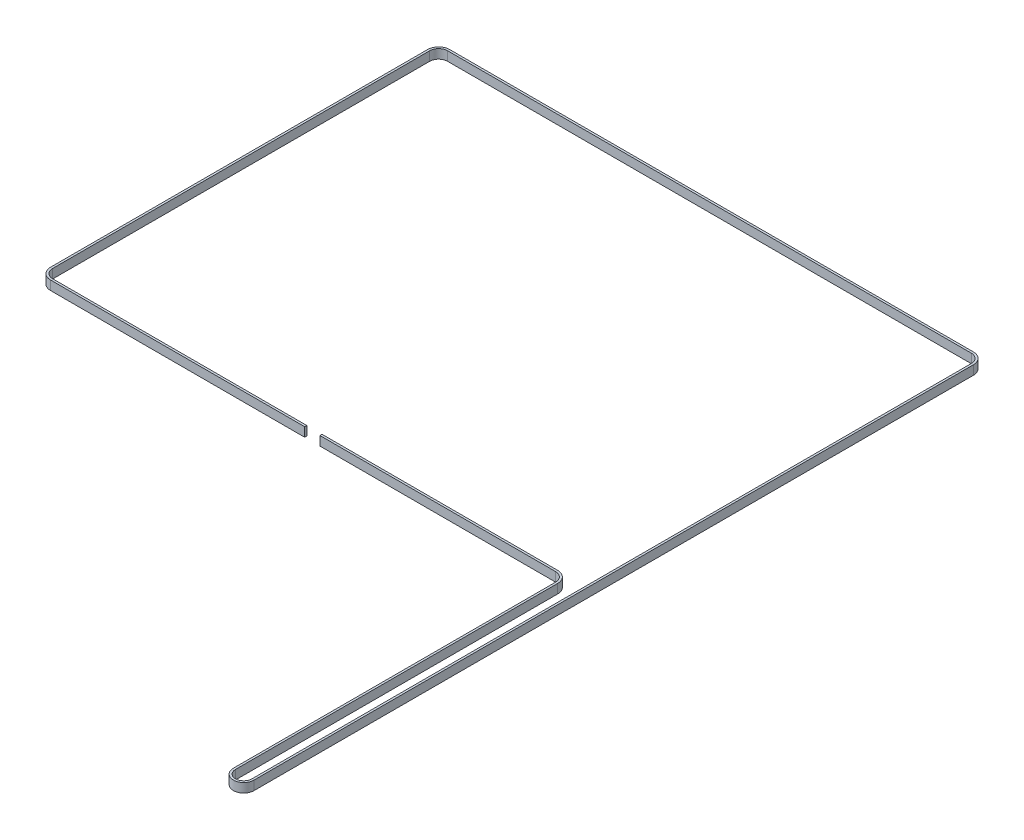
ISO-10303-21;
HEADER;
FILE_DESCRIPTION(('STEP AP214'),'2;1');
FILE_NAME('part.step','',(''),(''),'','','');
FILE_SCHEMA(('AUTOMOTIVE_DESIGN { 1 0 10303 214 1 1 1 1 }'));
ENDSEC;
DATA;
#1=APPLICATION_CONTEXT('core data for automotive mechanical design processes');
#2=APPLICATION_PROTOCOL_DEFINITION('international standard','automotive_design',2000,#1);
#3=PRODUCT_CONTEXT('',#1,'mechanical');
#4=PRODUCT('Part','Part','',(#3));
#5=PRODUCT_RELATED_PRODUCT_CATEGORY('part','',(#4));
#6=PRODUCT_DEFINITION_FORMATION('','',#4);
#7=PRODUCT_DEFINITION_CONTEXT('part definition',#1,'design');
#8=PRODUCT_DEFINITION('design','',#6,#7);
#9=PRODUCT_DEFINITION_SHAPE('','',#8);
#10=(LENGTH_UNIT() NAMED_UNIT(*) SI_UNIT(.MILLI.,.METRE.));
#11=(NAMED_UNIT(*) PLANE_ANGLE_UNIT() SI_UNIT($,.RADIAN.));
#12=(NAMED_UNIT(*) SI_UNIT($,.STERADIAN.) SOLID_ANGLE_UNIT());
#13=UNCERTAINTY_MEASURE_WITH_UNIT(LENGTH_MEASURE(1.E-05),#10,'distance_accuracy_value','');
#14=(GEOMETRIC_REPRESENTATION_CONTEXT(3) GLOBAL_UNCERTAINTY_ASSIGNED_CONTEXT((#13)) GLOBAL_UNIT_ASSIGNED_CONTEXT((#10,
#11,#12)) REPRESENTATION_CONTEXT('',''));
#15=CARTESIAN_POINT('',(0.,0.,0.));
#16=DIRECTION('',(0.,0.,1.));
#17=DIRECTION('',(1.,0.,0.));
#18=AXIS2_PLACEMENT_3D('',#15,#16,#17);
#19=CARTESIAN_POINT('',(6.87500000000002,6.,261.023481844307));
#20=DIRECTION('',(0.,0.,-1.));
#21=DIRECTION('',(-1.,0.,0.));
#22=AXIS2_PLACEMENT_3D('',#19,#20,#21);
#23=PLANE('',#22);
#24=DIRECTION('',(1.,0.,0.));
#25=VECTOR('',#24,1.);
#26=CARTESIAN_POINT('',(6.87500000000002,0.,261.023481844307));
#27=LINE('',#26,#25);
#28=CARTESIAN_POINT('',(6.87500000000002,0.,261.023481844307));
#29=VERTEX_POINT('',#28);
#30=CARTESIAN_POINT('',(173.28,0.,261.023481844307));
#31=VERTEX_POINT('',#30);
#32=EDGE_CURVE('E241',#29,#31,#27,.T.);
#33=ORIENTED_EDGE('',*,*,#32,.T.);
#34=DIRECTION('',(0.,-1.,0.));
#35=VECTOR('',#34,1.);
#36=CARTESIAN_POINT('',(173.28,6.,261.023481844307));
#37=LINE('',#36,#35);
#38=CARTESIAN_POINT('',(173.28,6.,261.023481844307));
#39=VERTEX_POINT('',#38);
#40=EDGE_CURVE('E11',#39,#31,#37,.T.);
#41=ORIENTED_EDGE('',*,*,#40,.F.);
#42=DIRECTION('',(1.,0.,0.));
#43=VECTOR('',#42,1.);
#44=CARTESIAN_POINT('',(6.87500000000002,6.,261.023481844307));
#45=LINE('',#44,#43);
#46=CARTESIAN_POINT('',(6.87500000000002,6.,261.023481844307));
#47=VERTEX_POINT('',#46);
#48=EDGE_CURVE('E150',#47,#39,#45,.T.);
#49=ORIENTED_EDGE('',*,*,#48,.F.);
#50=DIRECTION('',(0.,-1.,0.));
#51=VECTOR('',#50,1.);
#52=CARTESIAN_POINT('',(6.87500000000002,6.,261.023481844307));
#53=LINE('',#52,#51);
#54=EDGE_CURVE('E237',#47,#29,#53,.T.);
#55=ORIENTED_EDGE('',*,*,#54,.T.);
#56=EDGE_LOOP('',(#33,#41,#49,#55));
#57=FACE_BOUND('',#56,.T.);
#58=ADVANCED_FACE('F45',(#57),#23,.F.);
#59=CARTESIAN_POINT('',(173.28,6.,259.643481844307));
#60=DIRECTION('',(1.,0.,0.));
#61=DIRECTION('',(0.,0.,-1.));
#62=AXIS2_PLACEMENT_3D('',#59,#60,#61);
#63=PLANE('',#62);
#64=DIRECTION('',(0.,0.,1.));
#65=VECTOR('',#64,1.);
#66=CARTESIAN_POINT('',(173.28,0.,259.643481844307));
#67=LINE('',#66,#65);
#68=CARTESIAN_POINT('',(173.28,0.,259.643481844307));
#69=VERTEX_POINT('',#68);
#70=EDGE_CURVE('E245',#69,#31,#67,.T.);
#71=ORIENTED_EDGE('',*,*,#70,.F.);
#72=DIRECTION('',(0.,-1.,0.));
#73=VECTOR('',#72,1.);
#74=CARTESIAN_POINT('',(173.28,6.,259.643481844307));
#75=LINE('',#74,#73);
#76=CARTESIAN_POINT('',(173.28,6.,259.643481844307));
#77=VERTEX_POINT('',#76);
#78=EDGE_CURVE('E54',#77,#69,#75,.T.);
#79=ORIENTED_EDGE('',*,*,#78,.F.);
#80=DIRECTION('',(0.,0.,1.));
#81=VECTOR('',#80,1.);
#82=CARTESIAN_POINT('',(173.28,6.,259.643481844307));
#83=LINE('',#82,#81);
#84=EDGE_CURVE('E412',#77,#39,#83,.T.);
#85=ORIENTED_EDGE('',*,*,#84,.T.);
#86=ORIENTED_EDGE('',*,*,#40,.T.);
#87=EDGE_LOOP('',(#71,#79,#85,#86));
#88=FACE_BOUND('',#87,.T.);
#89=ADVANCED_FACE('F399',(#88),#63,.T.);
#90=CARTESIAN_POINT('',(6.87500000000002,6.,259.643481844307));
#91=DIRECTION('',(0.,0.,-1.));
#92=DIRECTION('',(-1.,0.,0.));
#93=AXIS2_PLACEMENT_3D('',#90,#91,#92);
#94=PLANE('',#93);
#95=DIRECTION('',(1.,0.,0.));
#96=VECTOR('',#95,1.);
#97=CARTESIAN_POINT('',(6.87500000000002,0.,259.643481844307));
#98=LINE('',#97,#96);
#99=CARTESIAN_POINT('',(6.87500000000002,0.,259.643481844307));
#100=VERTEX_POINT('',#99);
#101=EDGE_CURVE('E249',#100,#69,#98,.T.);
#102=ORIENTED_EDGE('',*,*,#101,.F.);
#103=DIRECTION('',(0.,-1.,0.));
#104=VECTOR('',#103,1.);
#105=CARTESIAN_POINT('',(6.87500000000002,6.,259.643481844307));
#106=LINE('',#105,#104);
#107=CARTESIAN_POINT('',(6.87500000000002,6.,259.643481844307));
#108=VERTEX_POINT('',#107);
#109=EDGE_CURVE('E387',#108,#100,#106,.T.);
#110=ORIENTED_EDGE('',*,*,#109,.F.);
#111=DIRECTION('',(1.,0.,0.));
#112=VECTOR('',#111,1.);
#113=CARTESIAN_POINT('',(6.87500000000002,6.,259.643481844307));
#114=LINE('',#113,#112);
#115=EDGE_CURVE('E396',#108,#77,#114,.T.);
#116=ORIENTED_EDGE('',*,*,#115,.T.);
#117=ORIENTED_EDGE('',*,*,#78,.T.);
#118=EDGE_LOOP('',(#102,#110,#116,#117));
#119=FACE_BOUND('',#118,.T.);
#120=ADVANCED_FACE('F394',(#119),#94,.T.);
#121=CARTESIAN_POINT('',(6.87500000000002,6.,253.772481844307));
#122=DIRECTION('',(0.,-1.,0.));
#123=DIRECTION('',(0.,0.,-1.));
#124=AXIS2_PLACEMENT_3D('',#121,#122,#123);
#125=CYLINDRICAL_SURFACE('',#124,5.87100000000002);
#126=CARTESIAN_POINT('',(6.87500000000002,0.,253.772481844307));
#127=DIRECTION('',(0.,1.,0.));
#128=DIRECTION('',(1.,0.,0.));
#129=AXIS2_PLACEMENT_3D('',#126,#127,#128);
#130=CIRCLE('',#129,5.87100000000002);
#131=CARTESIAN_POINT('',(1.004,0.,253.772481844307));
#132=VERTEX_POINT('',#131);
#133=EDGE_CURVE('E253',#132,#100,#130,.T.);
#134=ORIENTED_EDGE('',*,*,#133,.F.);
#135=DIRECTION('',(0.,-1.,0.));
#136=VECTOR('',#135,1.);
#137=CARTESIAN_POINT('',(1.004,6.,253.772481844307));
#138=LINE('',#137,#136);
#139=CARTESIAN_POINT('',(1.004,6.,253.772481844307));
#140=VERTEX_POINT('',#139);
#141=EDGE_CURVE('E384',#140,#132,#138,.T.);
#142=ORIENTED_EDGE('',*,*,#141,.F.);
#143=CARTESIAN_POINT('',(6.87500000000002,6.,253.772481844307));
#144=DIRECTION('',(0.,1.,0.));
#145=DIRECTION('',(1.,0.,0.));
#146=AXIS2_PLACEMENT_3D('',#143,#144,#145);
#147=CIRCLE('',#146,5.87100000000002);
#148=EDGE_CURVE('E409',#140,#108,#147,.T.);
#149=ORIENTED_EDGE('',*,*,#148,.T.);
#150=ORIENTED_EDGE('',*,*,#109,.T.);
#151=EDGE_LOOP('',(#134,#142,#149,#150));
#152=FACE_BOUND('',#151,.T.);
#153=ADVANCED_FACE('F406',(#152),#125,.F.);
#154=CARTESIAN_POINT('',(1.004,6.,6.875));
#155=DIRECTION('',(1.,0.,0.));
#156=DIRECTION('',(0.,0.,-1.));
#157=AXIS2_PLACEMENT_3D('',#154,#155,#156);
#158=PLANE('',#157);
#159=DIRECTION('',(0.,0.,-1.));
#160=VECTOR('',#159,1.);
#161=CARTESIAN_POINT('',(1.004,0.,6.875));
#162=LINE('',#161,#160);
#163=CARTESIAN_POINT('',(1.004,0.,6.875));
#164=VERTEX_POINT('',#163);
#165=EDGE_CURVE('E257',#164,#132,#162,.F.);
#166=ORIENTED_EDGE('',*,*,#165,.F.);
#167=DIRECTION('',(0.,-1.,0.));
#168=VECTOR('',#167,1.);
#169=CARTESIAN_POINT('',(1.004,6.,6.875));
#170=LINE('',#169,#168);
#171=CARTESIAN_POINT('',(1.004,6.,6.875));
#172=VERTEX_POINT('',#171);
#173=EDGE_CURVE('E381',#172,#164,#170,.T.);
#174=ORIENTED_EDGE('',*,*,#173,.F.);
#175=DIRECTION('',(0.,0.,-1.));
#176=VECTOR('',#175,1.);
#177=CARTESIAN_POINT('',(1.004,6.,6.875));
#178=LINE('',#177,#176);
#179=EDGE_CURVE('E417',#172,#140,#178,.F.);
#180=ORIENTED_EDGE('',*,*,#179,.T.);
#181=ORIENTED_EDGE('',*,*,#141,.T.);
#182=EDGE_LOOP('',(#166,#174,#180,#181));
#183=FACE_BOUND('',#182,.T.);
#184=ADVANCED_FACE('F510',(#183),#158,.T.);
#185=CARTESIAN_POINT('',(6.875,6.,6.875));
#186=DIRECTION('',(0.,-1.,0.));
#187=DIRECTION('',(0.,0.,-1.));
#188=AXIS2_PLACEMENT_3D('',#185,#186,#187);
#189=CYLINDRICAL_SURFACE('',#188,5.871);
#190=CARTESIAN_POINT('',(6.875,0.,6.875));
#191=DIRECTION('',(0.,1.,0.));
#192=DIRECTION('',(1.,0.,0.));
#193=AXIS2_PLACEMENT_3D('',#190,#191,#192);
#194=CIRCLE('',#193,5.871);
#195=CARTESIAN_POINT('',(6.875,0.,1.004));
#196=VERTEX_POINT('',#195);
#197=EDGE_CURVE('E261',#196,#164,#194,.T.);
#198=ORIENTED_EDGE('',*,*,#197,.F.);
#199=DIRECTION('',(0.,-1.,0.));
#200=VECTOR('',#199,1.);
#201=CARTESIAN_POINT('',(6.875,6.,1.004));
#202=LINE('',#201,#200);
#203=CARTESIAN_POINT('',(6.875,6.,1.004));
#204=VERTEX_POINT('',#203);
#205=EDGE_CURVE('E378',#204,#196,#202,.T.);
#206=ORIENTED_EDGE('',*,*,#205,.F.);
#207=CARTESIAN_POINT('',(6.875,6.,6.875));
#208=DIRECTION('',(0.,1.,0.));
#209=DIRECTION('',(1.,0.,0.));
#210=AXIS2_PLACEMENT_3D('',#207,#208,#209);
#211=CIRCLE('',#210,5.871);
#212=EDGE_CURVE('E424',#204,#172,#211,.T.);
#213=ORIENTED_EDGE('',*,*,#212,.T.);
#214=ORIENTED_EDGE('',*,*,#173,.T.);
#215=EDGE_LOOP('',(#198,#206,#213,#214));
#216=FACE_BOUND('',#215,.T.);
#217=ADVANCED_FACE('F513',(#216),#189,.F.);
#218=CARTESIAN_POINT('',(6.875,6.,1.004));
#219=DIRECTION('',(0.,0.,1.));
#220=DIRECTION('',(1.,0.,0.));
#221=AXIS2_PLACEMENT_3D('',#218,#219,#220);
#222=PLANE('',#221);
#223=DIRECTION('',(1.,0.,0.));
#224=VECTOR('',#223,1.);
#225=CARTESIAN_POINT('',(6.875,0.,1.004));
#226=LINE('',#225,#224);
#227=CARTESIAN_POINT('',(349.875,0.,1.004));
#228=VERTEX_POINT('',#227);
#229=EDGE_CURVE('E265',#228,#196,#226,.F.);
#230=ORIENTED_EDGE('',*,*,#229,.F.);
#231=DIRECTION('',(0.,-1.,0.));
#232=VECTOR('',#231,1.);
#233=CARTESIAN_POINT('',(349.875,6.,1.004));
#234=LINE('',#233,#232);
#235=CARTESIAN_POINT('',(349.875,6.,1.004));
#236=VERTEX_POINT('',#235);
#237=EDGE_CURVE('E375',#236,#228,#234,.T.);
#238=ORIENTED_EDGE('',*,*,#237,.F.);
#239=DIRECTION('',(1.,0.,0.));
#240=VECTOR('',#239,1.);
#241=CARTESIAN_POINT('',(6.875,6.,1.004));
#242=LINE('',#241,#240);
#243=EDGE_CURVE('E428',#236,#204,#242,.F.);
#244=ORIENTED_EDGE('',*,*,#243,.T.);
#245=ORIENTED_EDGE('',*,*,#205,.T.);
#246=EDGE_LOOP('',(#230,#238,#244,#245));
#247=FACE_BOUND('',#246,.T.);
#248=ADVANCED_FACE('F517',(#247),#222,.T.);
#249=CARTESIAN_POINT('',(349.875,6.,6.875));
#250=DIRECTION('',(0.,-1.,0.));
#251=DIRECTION('',(0.,0.,-1.));
#252=AXIS2_PLACEMENT_3D('',#249,#250,#251);
#253=CYLINDRICAL_SURFACE('',#252,5.87100000000001);
#254=CARTESIAN_POINT('',(349.875,0.,6.875));
#255=DIRECTION('',(0.,1.,0.));
#256=DIRECTION('',(1.,0.,0.));
#257=AXIS2_PLACEMENT_3D('',#254,#255,#256);
#258=CIRCLE('',#257,5.87100000000001);
#259=CARTESIAN_POINT('',(355.746,0.,6.875));
#260=VERTEX_POINT('',#259);
#261=EDGE_CURVE('E269',#260,#228,#258,.T.);
#262=ORIENTED_EDGE('',*,*,#261,.F.);
#263=DIRECTION('',(0.,-1.,0.));
#264=VECTOR('',#263,1.);
#265=CARTESIAN_POINT('',(355.746,6.,6.875));
#266=LINE('',#265,#264);
#267=CARTESIAN_POINT('',(355.746,6.,6.875));
#268=VERTEX_POINT('',#267);
#269=EDGE_CURVE('E372',#268,#260,#266,.T.);
#270=ORIENTED_EDGE('',*,*,#269,.F.);
#271=CARTESIAN_POINT('',(349.875,6.,6.875));
#272=DIRECTION('',(0.,1.,0.));
#273=DIRECTION('',(1.,0.,0.));
#274=AXIS2_PLACEMENT_3D('',#271,#272,#273);
#275=CIRCLE('',#274,5.87100000000001);
#276=EDGE_CURVE('E432',#268,#236,#275,.T.);
#277=ORIENTED_EDGE('',*,*,#276,.T.);
#278=ORIENTED_EDGE('',*,*,#237,.T.);
#279=EDGE_LOOP('',(#262,#270,#277,#278));
#280=FACE_BOUND('',#279,.T.);
#281=ADVANCED_FACE('F521',(#280),#253,.F.);
#282=CARTESIAN_POINT('',(355.746,6.,6.875));
#283=DIRECTION('',(-1.,0.,0.));
#284=DIRECTION('',(0.,0.,1.));
#285=AXIS2_PLACEMENT_3D('',#282,#283,#284);
#286=PLANE('',#285);
#287=DIRECTION('',(0.,0.,-1.));
#288=VECTOR('',#287,1.);
#289=CARTESIAN_POINT('',(355.746,0.,6.875));
#290=LINE('',#289,#288);
#291=CARTESIAN_POINT('',(355.746,0.,478.035));
#292=VERTEX_POINT('',#291);
#293=EDGE_CURVE('E273',#292,#260,#290,.T.);
#294=ORIENTED_EDGE('',*,*,#293,.F.);
#295=DIRECTION('',(0.,-1.,0.));
#296=VECTOR('',#295,1.);
#297=CARTESIAN_POINT('',(355.746,6.,478.035));
#298=LINE('',#297,#296);
#299=CARTESIAN_POINT('',(355.746,6.,478.035));
#300=VERTEX_POINT('',#299);
#301=EDGE_CURVE('E369',#300,#292,#298,.T.);
#302=ORIENTED_EDGE('',*,*,#301,.F.);
#303=DIRECTION('',(0.,0.,-1.));
#304=VECTOR('',#303,1.);
#305=CARTESIAN_POINT('',(355.746,6.,6.875));
#306=LINE('',#305,#304);
#307=EDGE_CURVE('E436',#300,#268,#306,.T.);
#308=ORIENTED_EDGE('',*,*,#307,.T.);
#309=ORIENTED_EDGE('',*,*,#269,.T.);
#310=EDGE_LOOP('',(#294,#302,#308,#309));
#311=FACE_BOUND('',#310,.T.);
#312=ADVANCED_FACE('F525',(#311),#286,.T.);
#313=CARTESIAN_POINT('',(350.38,6.,478.035));
#314=DIRECTION('',(0.,-1.,0.));
#315=DIRECTION('',(0.,0.,-1.));
#316=AXIS2_PLACEMENT_3D('',#313,#314,#315);
#317=CYLINDRICAL_SURFACE('',#316,5.36599999999996);
#318=CARTESIAN_POINT('',(350.38,0.,478.035));
#319=DIRECTION('',(0.,1.,0.));
#320=DIRECTION('',(1.,0.,0.));
#321=AXIS2_PLACEMENT_3D('',#318,#319,#320);
#322=CIRCLE('',#321,5.36599999999996);
#323=CARTESIAN_POINT('',(345.014,0.,478.035));
#324=VERTEX_POINT('',#323);
#325=EDGE_CURVE('E277',#324,#292,#322,.T.);
#326=ORIENTED_EDGE('',*,*,#325,.F.);
#327=DIRECTION('',(0.,-1.,0.));
#328=VECTOR('',#327,1.);
#329=CARTESIAN_POINT('',(345.014,6.,478.035));
#330=LINE('',#329,#328);
#331=CARTESIAN_POINT('',(345.014,6.,478.035));
#332=VERTEX_POINT('',#331);
#333=EDGE_CURVE('E366',#332,#324,#330,.T.);
#334=ORIENTED_EDGE('',*,*,#333,.F.);
#335=CARTESIAN_POINT('',(350.38,6.,478.035));
#336=DIRECTION('',(0.,1.,0.));
#337=DIRECTION('',(1.,0.,0.));
#338=AXIS2_PLACEMENT_3D('',#335,#336,#337);
#339=CIRCLE('',#338,5.36599999999996);
#340=EDGE_CURVE('E440',#332,#300,#339,.T.);
#341=ORIENTED_EDGE('',*,*,#340,.T.);
#342=ORIENTED_EDGE('',*,*,#301,.T.);
#343=EDGE_LOOP('',(#326,#334,#341,#342));
#344=FACE_BOUND('',#343,.T.);
#345=ADVANCED_FACE('F529',(#344),#317,.F.);
#346=CARTESIAN_POINT('',(345.014,6.,478.035));
#347=DIRECTION('',(1.,0.,0.));
#348=DIRECTION('',(0.,0.,-1.));
#349=AXIS2_PLACEMENT_3D('',#346,#347,#348);
#350=PLANE('',#349);
#351=DIRECTION('',(0.,0.,1.));
#352=VECTOR('',#351,1.);
#353=CARTESIAN_POINT('',(345.014,0.,478.035));
#354=LINE('',#353,#352);
#355=CARTESIAN_POINT('',(345.014,0.,267.017481844307));
#356=VERTEX_POINT('',#355);
#357=EDGE_CURVE('E281',#356,#324,#354,.T.);
#358=ORIENTED_EDGE('',*,*,#357,.F.);
#359=DIRECTION('',(0.,-1.,0.));
#360=VECTOR('',#359,1.);
#361=CARTESIAN_POINT('',(345.014,6.,267.017481844307));
#362=LINE('',#361,#360);
#363=CARTESIAN_POINT('',(345.014,6.,267.017481844307));
#364=VERTEX_POINT('',#363);
#365=EDGE_CURVE('E363',#364,#356,#362,.T.);
#366=ORIENTED_EDGE('',*,*,#365,.F.);
#367=DIRECTION('',(0.,0.,1.));
#368=VECTOR('',#367,1.);
#369=CARTESIAN_POINT('',(345.014,6.,478.035));
#370=LINE('',#369,#368);
#371=EDGE_CURVE('E444',#364,#332,#370,.T.);
#372=ORIENTED_EDGE('',*,*,#371,.T.);
#373=ORIENTED_EDGE('',*,*,#333,.T.);
#374=EDGE_LOOP('',(#358,#366,#372,#373));
#375=FACE_BOUND('',#374,.T.);
#376=ADVANCED_FACE('F533',(#375),#350,.T.);
#377=CARTESIAN_POINT('',(337.64,6.,267.017481844307));
#378=DIRECTION('',(0.,-1.,0.));
#379=DIRECTION('',(0.,0.,-1.));
#380=AXIS2_PLACEMENT_3D('',#377,#378,#379);
#381=CYLINDRICAL_SURFACE('',#380,7.37399999999996);
#382=CARTESIAN_POINT('',(337.64,0.,267.017481844307));
#383=DIRECTION('',(0.,1.,0.));
#384=DIRECTION('',(1.,0.,0.));
#385=AXIS2_PLACEMENT_3D('',#382,#383,#384);
#386=CIRCLE('',#385,7.37399999999996);
#387=CARTESIAN_POINT('',(337.64,0.,259.643481844308));
#388=VERTEX_POINT('',#387);
#389=EDGE_CURVE('E285',#388,#356,#386,.F.);
#390=ORIENTED_EDGE('',*,*,#389,.F.);
#391=DIRECTION('',(0.,-1.,0.));
#392=VECTOR('',#391,1.);
#393=CARTESIAN_POINT('',(337.64,6.,259.643481844308));
#394=LINE('',#393,#392);
#395=CARTESIAN_POINT('',(337.64,6.,259.643481844308));
#396=VERTEX_POINT('',#395);
#397=EDGE_CURVE('E360',#396,#388,#394,.T.);
#398=ORIENTED_EDGE('',*,*,#397,.F.);
#399=CARTESIAN_POINT('',(337.64,6.,267.017481844307));
#400=DIRECTION('',(0.,1.,0.));
#401=DIRECTION('',(1.,0.,0.));
#402=AXIS2_PLACEMENT_3D('',#399,#400,#401);
#403=CIRCLE('',#402,7.37399999999996);
#404=EDGE_CURVE('E448',#396,#364,#403,.F.);
#405=ORIENTED_EDGE('',*,*,#404,.T.);
#406=ORIENTED_EDGE('',*,*,#365,.T.);
#407=EDGE_LOOP('',(#390,#398,#405,#406));
#408=FACE_BOUND('',#407,.T.);
#409=ADVANCED_FACE('F537',(#408),#381,.T.);
#410=CARTESIAN_POINT('',(337.64,6.,259.643481844307));
#411=DIRECTION('',(0.,0.,-1.));
#412=DIRECTION('',(-1.,0.,0.));
#413=AXIS2_PLACEMENT_3D('',#410,#411,#412);
#414=PLANE('',#413);
#415=DIRECTION('',(1.,0.,0.));
#416=VECTOR('',#415,1.);
#417=CARTESIAN_POINT('',(337.64,0.,259.643481844307));
#418=LINE('',#417,#416);
#419=CARTESIAN_POINT('',(183.275,0.,259.643481844307));
#420=VERTEX_POINT('',#419);
#421=EDGE_CURVE('E289',#420,#388,#418,.T.);
#422=ORIENTED_EDGE('',*,*,#421,.F.);
#423=DIRECTION('',(0.,-1.,0.));
#424=VECTOR('',#423,1.);
#425=CARTESIAN_POINT('',(183.275,6.,259.643481844307));
#426=LINE('',#425,#424);
#427=CARTESIAN_POINT('',(183.275,6.,259.643481844307));
#428=VERTEX_POINT('',#427);
#429=EDGE_CURVE('E357',#428,#420,#426,.T.);
#430=ORIENTED_EDGE('',*,*,#429,.F.);
#431=DIRECTION('',(1.,0.,0.));
#432=VECTOR('',#431,1.);
#433=CARTESIAN_POINT('',(337.64,6.,259.643481844307));
#434=LINE('',#433,#432);
#435=EDGE_CURVE('E452',#428,#396,#434,.T.);
#436=ORIENTED_EDGE('',*,*,#435,.T.);
#437=ORIENTED_EDGE('',*,*,#397,.T.);
#438=EDGE_LOOP('',(#422,#430,#436,#437));
#439=FACE_BOUND('',#438,.T.);
#440=ADVANCED_FACE('F541',(#439),#414,.T.);
#441=CARTESIAN_POINT('',(183.275,6.,261.023481844307));
#442=DIRECTION('',(-1.,0.,0.));
#443=DIRECTION('',(0.,0.,1.));
#444=AXIS2_PLACEMENT_3D('',#441,#442,#443);
#445=PLANE('',#444);
#446=DIRECTION('',(0.,0.,-1.));
#447=VECTOR('',#446,1.);
#448=CARTESIAN_POINT('',(183.275,0.,261.023481844307));
#449=LINE('',#448,#447);
#450=CARTESIAN_POINT('',(183.275,0.,261.023481844307));
#451=VERTEX_POINT('',#450);
#452=EDGE_CURVE('E293',#451,#420,#449,.T.);
#453=ORIENTED_EDGE('',*,*,#452,.F.);
#454=DIRECTION('',(0.,-1.,0.));
#455=VECTOR('',#454,1.);
#456=CARTESIAN_POINT('',(183.275,6.,261.023481844307));
#457=LINE('',#456,#455);
#458=CARTESIAN_POINT('',(183.275,6.,261.023481844307));
#459=VERTEX_POINT('',#458);
#460=EDGE_CURVE('E354',#459,#451,#457,.T.);
#461=ORIENTED_EDGE('',*,*,#460,.F.);
#462=DIRECTION('',(0.,0.,-1.));
#463=VECTOR('',#462,1.);
#464=CARTESIAN_POINT('',(183.275,6.,261.023481844307));
#465=LINE('',#464,#463);
#466=EDGE_CURVE('E456',#459,#428,#465,.T.);
#467=ORIENTED_EDGE('',*,*,#466,.T.);
#468=ORIENTED_EDGE('',*,*,#429,.T.);
#469=EDGE_LOOP('',(#453,#461,#467,#468));
#470=FACE_BOUND('',#469,.T.);
#471=ADVANCED_FACE('F545',(#470),#445,.T.);
#472=CARTESIAN_POINT('',(337.64,6.,261.023481844307));
#473=DIRECTION('',(0.,0.,-1.));
#474=DIRECTION('',(-1.,0.,0.));
#475=AXIS2_PLACEMENT_3D('',#472,#473,#474);
#476=PLANE('',#475);
#477=DIRECTION('',(1.,0.,0.));
#478=VECTOR('',#477,1.);
#479=CARTESIAN_POINT('',(337.64,0.,261.023481844307));
#480=LINE('',#479,#478);
#481=CARTESIAN_POINT('',(337.64,0.,261.023481844308));
#482=VERTEX_POINT('',#481);
#483=EDGE_CURVE('E297',#451,#482,#480,.T.);
#484=ORIENTED_EDGE('',*,*,#483,.T.);
#485=DIRECTION('',(0.,-1.,0.));
#486=VECTOR('',#485,1.);
#487=CARTESIAN_POINT('',(337.64,6.,261.023481844308));
#488=LINE('',#487,#486);
#489=CARTESIAN_POINT('',(337.64,6.,261.023481844308));
#490=VERTEX_POINT('',#489);
#491=EDGE_CURVE('E350',#490,#482,#488,.T.);
#492=ORIENTED_EDGE('',*,*,#491,.F.);
#493=DIRECTION('',(1.,0.,0.));
#494=VECTOR('',#493,1.);
#495=CARTESIAN_POINT('',(337.64,6.,261.023481844307));
#496=LINE('',#495,#494);
#497=EDGE_CURVE('E460',#459,#490,#496,.T.);
#498=ORIENTED_EDGE('',*,*,#497,.F.);
#499=ORIENTED_EDGE('',*,*,#460,.T.);
#500=EDGE_LOOP('',(#484,#492,#498,#499));
#501=FACE_BOUND('',#500,.T.);
#502=ADVANCED_FACE('F549',(#501),#476,.F.);
#503=CARTESIAN_POINT('',(337.64,6.,267.017481844307));
#504=DIRECTION('',(0.,-1.,0.));
#505=DIRECTION('',(0.,0.,-1.));
#506=AXIS2_PLACEMENT_3D('',#503,#504,#505);
#507=CYLINDRICAL_SURFACE('',#506,5.99399999999996);
#508=CARTESIAN_POINT('',(337.64,0.,267.017481844307));
#509=DIRECTION('',(0.,1.,0.));
#510=DIRECTION('',(1.,0.,0.));
#511=AXIS2_PLACEMENT_3D('',#508,#509,#510);
#512=CIRCLE('',#511,5.99399999999996);
#513=CARTESIAN_POINT('',(343.634,0.,267.017481844307));
#514=VERTEX_POINT('',#513);
#515=EDGE_CURVE('E300',#482,#514,#512,.F.);
#516=ORIENTED_EDGE('',*,*,#515,.T.);
#517=DIRECTION('',(0.,-1.,0.));
#518=VECTOR('',#517,1.);
#519=CARTESIAN_POINT('',(343.634,6.,267.017481844307));
#520=LINE('',#519,#518);
#521=CARTESIAN_POINT('',(343.634,6.,267.017481844307));
#522=VERTEX_POINT('',#521);
#523=EDGE_CURVE('E346',#522,#514,#520,.T.);
#524=ORIENTED_EDGE('',*,*,#523,.F.);
#525=CARTESIAN_POINT('',(337.64,6.,267.017481844307));
#526=DIRECTION('',(0.,1.,0.));
#527=DIRECTION('',(1.,0.,0.));
#528=AXIS2_PLACEMENT_3D('',#525,#526,#527);
#529=CIRCLE('',#528,5.99399999999996);
#530=EDGE_CURVE('E463',#490,#522,#529,.F.);
#531=ORIENTED_EDGE('',*,*,#530,.F.);
#532=ORIENTED_EDGE('',*,*,#491,.T.);
#533=EDGE_LOOP('',(#516,#524,#531,#532));
#534=FACE_BOUND('',#533,.T.);
#535=ADVANCED_FACE('F553',(#534),#507,.F.);
#536=CARTESIAN_POINT('',(343.634,6.,478.035));
#537=DIRECTION('',(1.,0.,0.));
#538=DIRECTION('',(0.,0.,-1.));
#539=AXIS2_PLACEMENT_3D('',#536,#537,#538);
#540=PLANE('',#539);
#541=DIRECTION('',(0.,0.,1.));
#542=VECTOR('',#541,1.);
#543=CARTESIAN_POINT('',(343.634,0.,478.035));
#544=LINE('',#543,#542);
#545=CARTESIAN_POINT('',(343.634,0.,478.035));
#546=VERTEX_POINT('',#545);
#547=EDGE_CURVE('E303',#514,#546,#544,.T.);
#548=ORIENTED_EDGE('',*,*,#547,.T.);
#549=DIRECTION('',(0.,-1.,0.));
#550=VECTOR('',#549,1.);
#551=CARTESIAN_POINT('',(343.634,6.,478.035));
#552=LINE('',#551,#550);
#553=CARTESIAN_POINT('',(343.634,6.,478.035));
#554=VERTEX_POINT('',#553);
#555=EDGE_CURVE('E342',#554,#546,#552,.T.);
#556=ORIENTED_EDGE('',*,*,#555,.F.);
#557=DIRECTION('',(0.,0.,1.));
#558=VECTOR('',#557,1.);
#559=CARTESIAN_POINT('',(343.634,6.,478.035));
#560=LINE('',#559,#558);
#561=EDGE_CURVE('E466',#522,#554,#560,.T.);
#562=ORIENTED_EDGE('',*,*,#561,.F.);
#563=ORIENTED_EDGE('',*,*,#523,.T.);
#564=EDGE_LOOP('',(#548,#556,#562,#563));
#565=FACE_BOUND('',#564,.T.);
#566=ADVANCED_FACE('F557',(#565),#540,.F.);
#567=CARTESIAN_POINT('',(350.38,6.,478.035));
#568=DIRECTION('',(0.,-1.,0.));
#569=DIRECTION('',(0.,0.,-1.));
#570=AXIS2_PLACEMENT_3D('',#567,#568,#569);
#571=CYLINDRICAL_SURFACE('',#570,6.74599999999996);
#572=CARTESIAN_POINT('',(350.38,0.,478.035));
#573=DIRECTION('',(0.,1.,0.));
#574=DIRECTION('',(1.,0.,0.));
#575=AXIS2_PLACEMENT_3D('',#572,#573,#574);
#576=CIRCLE('',#575,6.74599999999996);
#577=CARTESIAN_POINT('',(357.126,0.,478.035));
#578=VERTEX_POINT('',#577);
#579=EDGE_CURVE('E306',#546,#578,#576,.T.);
#580=ORIENTED_EDGE('',*,*,#579,.T.);
#581=DIRECTION('',(0.,-1.,0.));
#582=VECTOR('',#581,1.);
#583=CARTESIAN_POINT('',(357.126,6.,478.035));
#584=LINE('',#583,#582);
#585=CARTESIAN_POINT('',(357.126,6.,478.035));
#586=VERTEX_POINT('',#585);
#587=EDGE_CURVE('E338',#586,#578,#584,.T.);
#588=ORIENTED_EDGE('',*,*,#587,.F.);
#589=CARTESIAN_POINT('',(350.38,6.,478.035));
#590=DIRECTION('',(0.,1.,0.));
#591=DIRECTION('',(1.,0.,0.));
#592=AXIS2_PLACEMENT_3D('',#589,#590,#591);
#593=CIRCLE('',#592,6.74599999999996);
#594=EDGE_CURVE('E469',#554,#586,#593,.T.);
#595=ORIENTED_EDGE('',*,*,#594,.F.);
#596=ORIENTED_EDGE('',*,*,#555,.T.);
#597=EDGE_LOOP('',(#580,#588,#595,#596));
#598=FACE_BOUND('',#597,.T.);
#599=ADVANCED_FACE('F561',(#598),#571,.T.);
#600=CARTESIAN_POINT('',(357.126,6.,6.875));
#601=DIRECTION('',(-1.,0.,0.));
#602=DIRECTION('',(0.,0.,1.));
#603=AXIS2_PLACEMENT_3D('',#600,#601,#602);
#604=PLANE('',#603);
#605=DIRECTION('',(0.,0.,-1.));
#606=VECTOR('',#605,1.);
#607=CARTESIAN_POINT('',(357.126,0.,6.875));
#608=LINE('',#607,#606);
#609=CARTESIAN_POINT('',(357.126,0.,6.875));
#610=VERTEX_POINT('',#609);
#611=EDGE_CURVE('E309',#578,#610,#608,.T.);
#612=ORIENTED_EDGE('',*,*,#611,.T.);
#613=DIRECTION('',(0.,-1.,0.));
#614=VECTOR('',#613,1.);
#615=CARTESIAN_POINT('',(357.126,6.,6.875));
#616=LINE('',#615,#614);
#617=CARTESIAN_POINT('',(357.126,6.,6.875));
#618=VERTEX_POINT('',#617);
#619=EDGE_CURVE('E334',#618,#610,#616,.T.);
#620=ORIENTED_EDGE('',*,*,#619,.F.);
#621=DIRECTION('',(0.,0.,-1.));
#622=VECTOR('',#621,1.);
#623=CARTESIAN_POINT('',(357.126,6.,6.875));
#624=LINE('',#623,#622);
#625=EDGE_CURVE('E472',#586,#618,#624,.T.);
#626=ORIENTED_EDGE('',*,*,#625,.F.);
#627=ORIENTED_EDGE('',*,*,#587,.T.);
#628=EDGE_LOOP('',(#612,#620,#626,#627));
#629=FACE_BOUND('',#628,.T.);
#630=ADVANCED_FACE('F565',(#629),#604,.F.);
#631=CARTESIAN_POINT('',(349.875,6.,6.875));
#632=DIRECTION('',(0.,-1.,0.));
#633=DIRECTION('',(0.,0.,-1.));
#634=AXIS2_PLACEMENT_3D('',#631,#632,#633);
#635=CYLINDRICAL_SURFACE('',#634,7.25100000000001);
#636=CARTESIAN_POINT('',(349.875,0.,6.875));
#637=DIRECTION('',(0.,1.,0.));
#638=DIRECTION('',(1.,0.,0.));
#639=AXIS2_PLACEMENT_3D('',#636,#637,#638);
#640=CIRCLE('',#639,7.25100000000001);
#641=CARTESIAN_POINT('',(349.875,0.,-0.376));
#642=VERTEX_POINT('',#641);
#643=EDGE_CURVE('E312',#610,#642,#640,.T.);
#644=ORIENTED_EDGE('',*,*,#643,.T.);
#645=DIRECTION('',(0.,-1.,0.));
#646=VECTOR('',#645,1.);
#647=CARTESIAN_POINT('',(349.875,6.,-0.376));
#648=LINE('',#647,#646);
#649=CARTESIAN_POINT('',(349.875,6.,-0.376));
#650=VERTEX_POINT('',#649);
#651=EDGE_CURVE('E330',#650,#642,#648,.T.);
#652=ORIENTED_EDGE('',*,*,#651,.F.);
#653=CARTESIAN_POINT('',(349.875,6.,6.875));
#654=DIRECTION('',(0.,1.,0.));
#655=DIRECTION('',(1.,0.,0.));
#656=AXIS2_PLACEMENT_3D('',#653,#654,#655);
#657=CIRCLE('',#656,7.25100000000001);
#658=EDGE_CURVE('E475',#618,#650,#657,.T.);
#659=ORIENTED_EDGE('',*,*,#658,.F.);
#660=ORIENTED_EDGE('',*,*,#619,.T.);
#661=EDGE_LOOP('',(#644,#652,#659,#660));
#662=FACE_BOUND('',#661,.T.);
#663=ADVANCED_FACE('F483',(#662),#635,.T.);
#664=CARTESIAN_POINT('',(6.875,6.,-0.376));
#665=DIRECTION('',(0.,0.,1.));
#666=DIRECTION('',(1.,0.,0.));
#667=AXIS2_PLACEMENT_3D('',#664,#665,#666);
#668=PLANE('',#667);
#669=DIRECTION('',(1.,0.,0.));
#670=VECTOR('',#669,1.);
#671=CARTESIAN_POINT('',(6.875,0.,-0.376));
#672=LINE('',#671,#670);
#673=CARTESIAN_POINT('',(6.875,0.,-0.376));
#674=VERTEX_POINT('',#673);
#675=EDGE_CURVE('E315',#642,#674,#672,.F.);
#676=ORIENTED_EDGE('',*,*,#675,.T.);
#677=DIRECTION('',(0.,-1.,0.));
#678=VECTOR('',#677,1.);
#679=CARTESIAN_POINT('',(6.875,6.,-0.376));
#680=LINE('',#679,#678);
#681=CARTESIAN_POINT('',(6.875,6.,-0.376));
#682=VERTEX_POINT('',#681);
#683=EDGE_CURVE('E230',#682,#674,#680,.T.);
#684=ORIENTED_EDGE('',*,*,#683,.F.);
#685=DIRECTION('',(1.,0.,0.));
#686=VECTOR('',#685,1.);
#687=CARTESIAN_POINT('',(6.875,6.,-0.376));
#688=LINE('',#687,#686);
#689=EDGE_CURVE('E219',#650,#682,#688,.F.);
#690=ORIENTED_EDGE('',*,*,#689,.F.);
#691=ORIENTED_EDGE('',*,*,#651,.T.);
#692=EDGE_LOOP('',(#676,#684,#690,#691));
#693=FACE_BOUND('',#692,.T.);
#694=ADVANCED_FACE('F487',(#693),#668,.F.);
#695=CARTESIAN_POINT('',(6.875,6.,6.875));
#696=DIRECTION('',(0.,-1.,0.));
#697=DIRECTION('',(0.,0.,-1.));
#698=AXIS2_PLACEMENT_3D('',#695,#696,#697);
#699=CYLINDRICAL_SURFACE('',#698,7.251);
#700=CARTESIAN_POINT('',(6.875,0.,6.875));
#701=DIRECTION('',(0.,1.,0.));
#702=DIRECTION('',(1.,0.,0.));
#703=AXIS2_PLACEMENT_3D('',#700,#701,#702);
#704=CIRCLE('',#703,7.251);
#705=CARTESIAN_POINT('',(-0.376,0.,6.875));
#706=VERTEX_POINT('',#705);
#707=EDGE_CURVE('E228',#674,#706,#704,.T.);
#708=ORIENTED_EDGE('',*,*,#707,.T.);
#709=DIRECTION('',(0.,-1.,0.));
#710=VECTOR('',#709,1.);
#711=CARTESIAN_POINT('',(-0.376,6.,6.875));
#712=LINE('',#711,#710);
#713=CARTESIAN_POINT('',(-0.376,6.,6.875));
#714=VERTEX_POINT('',#713);
#715=EDGE_CURVE('E225',#714,#706,#712,.T.);
#716=ORIENTED_EDGE('',*,*,#715,.F.);
#717=CARTESIAN_POINT('',(6.875,6.,6.875));
#718=DIRECTION('',(0.,1.,0.));
#719=DIRECTION('',(1.,0.,0.));
#720=AXIS2_PLACEMENT_3D('',#717,#718,#719);
#721=CIRCLE('',#720,7.251);
#722=EDGE_CURVE('E213',#682,#714,#721,.T.);
#723=ORIENTED_EDGE('',*,*,#722,.F.);
#724=ORIENTED_EDGE('',*,*,#683,.T.);
#725=EDGE_LOOP('',(#708,#716,#723,#724));
#726=FACE_BOUND('',#725,.T.);
#727=ADVANCED_FACE('F226',(#726),#699,.T.);
#728=CARTESIAN_POINT('',(-0.376,6.,6.875));
#729=DIRECTION('',(1.,0.,0.));
#730=DIRECTION('',(0.,0.,-1.));
#731=AXIS2_PLACEMENT_3D('',#728,#729,#730);
#732=PLANE('',#731);
#733=DIRECTION('',(0.,0.,-1.));
#734=VECTOR('',#733,1.);
#735=CARTESIAN_POINT('',(-0.376,0.,6.875));
#736=LINE('',#735,#734);
#737=CARTESIAN_POINT('',(-0.376000000000002,0.,253.772481844307));
#738=VERTEX_POINT('',#737);
#739=EDGE_CURVE('E138',#706,#738,#736,.F.);
#740=ORIENTED_EDGE('',*,*,#739,.T.);
#741=DIRECTION('',(0.,-1.,0.));
#742=VECTOR('',#741,1.);
#743=CARTESIAN_POINT('',(-0.376000000000002,6.,253.772481844307));
#744=LINE('',#743,#742);
#745=CARTESIAN_POINT('',(-0.376000000000002,6.,253.772481844307));
#746=VERTEX_POINT('',#745);
#747=EDGE_CURVE('E231',#746,#738,#744,.T.);
#748=ORIENTED_EDGE('',*,*,#747,.F.);
#749=DIRECTION('',(0.,0.,-1.));
#750=VECTOR('',#749,1.);
#751=CARTESIAN_POINT('',(-0.376,6.,6.875));
#752=LINE('',#751,#750);
#753=EDGE_CURVE('E217',#714,#746,#752,.F.);
#754=ORIENTED_EDGE('',*,*,#753,.F.);
#755=ORIENTED_EDGE('',*,*,#715,.T.);
#756=EDGE_LOOP('',(#740,#748,#754,#755));
#757=FACE_BOUND('',#756,.T.);
#758=ADVANCED_FACE('F233',(#757),#732,.F.);
#759=CARTESIAN_POINT('',(6.87500000000002,6.,253.772481844307));
#760=DIRECTION('',(0.,-1.,0.));
#761=DIRECTION('',(0.,0.,-1.));
#762=AXIS2_PLACEMENT_3D('',#759,#760,#761);
#763=CYLINDRICAL_SURFACE('',#762,7.25100000000002);
#764=CARTESIAN_POINT('',(6.87500000000002,0.,253.772481844307));
#765=DIRECTION('',(0.,1.,0.));
#766=DIRECTION('',(1.,0.,0.));
#767=AXIS2_PLACEMENT_3D('',#764,#765,#766);
#768=CIRCLE('',#767,7.25100000000002);
#769=EDGE_CURVE('E144',#738,#29,#768,.T.);
#770=ORIENTED_EDGE('',*,*,#769,.T.);
#771=ORIENTED_EDGE('',*,*,#54,.F.);
#772=CARTESIAN_POINT('',(6.87500000000002,6.,253.772481844307));
#773=DIRECTION('',(0.,1.,0.));
#774=DIRECTION('',(1.,0.,0.));
#775=AXIS2_PLACEMENT_3D('',#772,#773,#774);
#776=CIRCLE('',#775,7.25100000000002);
#777=EDGE_CURVE('E62',#746,#47,#776,.T.);
#778=ORIENTED_EDGE('',*,*,#777,.F.);
#779=ORIENTED_EDGE('',*,*,#747,.T.);
#780=EDGE_LOOP('',(#770,#771,#778,#779));
#781=FACE_BOUND('',#780,.T.);
#782=ADVANCED_FACE('F489',(#781),#763,.T.);
#783=CARTESIAN_POINT('',(6.87500000000002,6.,253.772481844307));
#784=DIRECTION('',(0.,1.,0.));
#785=DIRECTION('',(1.,0.,0.));
#786=AXIS2_PLACEMENT_3D('',#783,#784,#785);
#787=PLANE('',#786);
#788=ORIENTED_EDGE('',*,*,#48,.T.);
#789=ORIENTED_EDGE('',*,*,#84,.F.);
#790=ORIENTED_EDGE('',*,*,#115,.F.);
#791=ORIENTED_EDGE('',*,*,#148,.F.);
#792=ORIENTED_EDGE('',*,*,#179,.F.);
#793=ORIENTED_EDGE('',*,*,#212,.F.);
#794=ORIENTED_EDGE('',*,*,#243,.F.);
#795=ORIENTED_EDGE('',*,*,#276,.F.);
#796=ORIENTED_EDGE('',*,*,#307,.F.);
#797=ORIENTED_EDGE('',*,*,#340,.F.);
#798=ORIENTED_EDGE('',*,*,#371,.F.);
#799=ORIENTED_EDGE('',*,*,#404,.F.);
#800=ORIENTED_EDGE('',*,*,#435,.F.);
#801=ORIENTED_EDGE('',*,*,#466,.F.);
#802=ORIENTED_EDGE('',*,*,#497,.T.);
#803=ORIENTED_EDGE('',*,*,#530,.T.);
#804=ORIENTED_EDGE('',*,*,#561,.T.);
#805=ORIENTED_EDGE('',*,*,#594,.T.);
#806=ORIENTED_EDGE('',*,*,#625,.T.);
#807=ORIENTED_EDGE('',*,*,#658,.T.);
#808=ORIENTED_EDGE('',*,*,#689,.T.);
#809=ORIENTED_EDGE('',*,*,#722,.T.);
#810=ORIENTED_EDGE('',*,*,#753,.T.);
#811=ORIENTED_EDGE('',*,*,#777,.T.);
#812=EDGE_LOOP('',(#788,#789,#790,#791,#792,#793,#794,#795,#796,#797,#798,#799,#800,#801,#802,
#803,#804,#805,#806,#807,#808,#809,#810,#811));
#813=FACE_BOUND('',#812,.T.);
#814=ADVANCED_FACE('F215',(#813),#787,.T.);
#815=CARTESIAN_POINT('',(6.87500000000002,0.,253.772481844307));
#816=DIRECTION('',(0.,1.,0.));
#817=DIRECTION('',(1.,0.,0.));
#818=AXIS2_PLACEMENT_3D('',#815,#816,#817);
#819=PLANE('',#818);
#820=ORIENTED_EDGE('',*,*,#32,.F.);
#821=ORIENTED_EDGE('',*,*,#769,.F.);
#822=ORIENTED_EDGE('',*,*,#739,.F.);
#823=ORIENTED_EDGE('',*,*,#707,.F.);
#824=ORIENTED_EDGE('',*,*,#675,.F.);
#825=ORIENTED_EDGE('',*,*,#643,.F.);
#826=ORIENTED_EDGE('',*,*,#611,.F.);
#827=ORIENTED_EDGE('',*,*,#579,.F.);
#828=ORIENTED_EDGE('',*,*,#547,.F.);
#829=ORIENTED_EDGE('',*,*,#515,.F.);
#830=ORIENTED_EDGE('',*,*,#483,.F.);
#831=ORIENTED_EDGE('',*,*,#452,.T.);
#832=ORIENTED_EDGE('',*,*,#421,.T.);
#833=ORIENTED_EDGE('',*,*,#389,.T.);
#834=ORIENTED_EDGE('',*,*,#357,.T.);
#835=ORIENTED_EDGE('',*,*,#325,.T.);
#836=ORIENTED_EDGE('',*,*,#293,.T.);
#837=ORIENTED_EDGE('',*,*,#261,.T.);
#838=ORIENTED_EDGE('',*,*,#229,.T.);
#839=ORIENTED_EDGE('',*,*,#197,.T.);
#840=ORIENTED_EDGE('',*,*,#165,.T.);
#841=ORIENTED_EDGE('',*,*,#133,.T.);
#842=ORIENTED_EDGE('',*,*,#101,.T.);
#843=ORIENTED_EDGE('',*,*,#70,.T.);
#844=EDGE_LOOP('',(#820,#821,#822,#823,#824,#825,#826,#827,#828,#829,#830,#831,#832,#833,#834,
#835,#836,#837,#838,#839,#840,#841,#842,#843));
#845=FACE_BOUND('',#844,.T.);
#846=ADVANCED_FACE('F402',(#845),#819,.F.);
#847=CLOSED_SHELL('',(#58,#89,#120,#153,#184,#217,#248,#281,#312,#345,#376,#409,#440,#471,#502,
#535,#566,#599,#630,#663,#694,#727,#758,#782,#814,#846));
#848=MANIFOLD_SOLID_BREP('B2',#847);
#849=ADVANCED_BREP_SHAPE_REPRESENTATION('',(#18,#848),#14);
#850=SHAPE_DEFINITION_REPRESENTATION(#9,#849);
ENDSEC;
END-ISO-10303-21;
